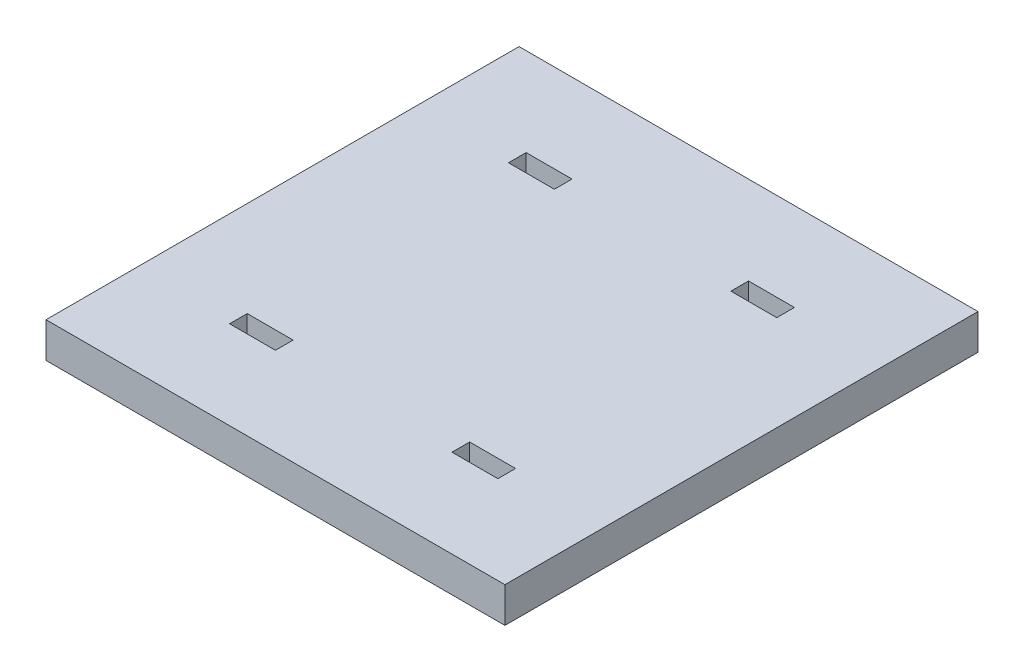
ISO-10303-21;
HEADER;
FILE_DESCRIPTION(('STEP AP214'),'2;1');
FILE_NAME('part.step','',(''),(''),'','','');
FILE_SCHEMA(('AUTOMOTIVE_DESIGN { 1 0 10303 214 1 1 1 1 }'));
ENDSEC;
DATA;
#1=APPLICATION_CONTEXT('core data for automotive mechanical design processes');
#2=APPLICATION_PROTOCOL_DEFINITION('international standard','automotive_design',2000,#1);
#3=PRODUCT_CONTEXT('',#1,'mechanical');
#4=PRODUCT('Part','Part','',(#3));
#5=PRODUCT_RELATED_PRODUCT_CATEGORY('part','',(#4));
#6=PRODUCT_DEFINITION_FORMATION('','',#4);
#7=PRODUCT_DEFINITION_CONTEXT('part definition',#1,'design');
#8=PRODUCT_DEFINITION('design','',#6,#7);
#9=PRODUCT_DEFINITION_SHAPE('','',#8);
#10=(LENGTH_UNIT() NAMED_UNIT(*) SI_UNIT(.MILLI.,.METRE.));
#11=(NAMED_UNIT(*) PLANE_ANGLE_UNIT() SI_UNIT($,.RADIAN.));
#12=(NAMED_UNIT(*) SI_UNIT($,.STERADIAN.) SOLID_ANGLE_UNIT());
#13=UNCERTAINTY_MEASURE_WITH_UNIT(LENGTH_MEASURE(1.E-05),#10,'distance_accuracy_value','');
#14=(GEOMETRIC_REPRESENTATION_CONTEXT(3) GLOBAL_UNCERTAINTY_ASSIGNED_CONTEXT((#13)) GLOBAL_UNIT_ASSIGNED_CONTEXT((#10,
#11,#12)) REPRESENTATION_CONTEXT('',''));
#15=CARTESIAN_POINT('',(0.,0.,0.));
#16=DIRECTION('',(0.,0.,1.));
#17=DIRECTION('',(1.,0.,0.));
#18=AXIS2_PLACEMENT_3D('',#15,#16,#17);
#19=CARTESIAN_POINT('',(0.,10.,0.));
#20=DIRECTION('',(0.,-1.,0.));
#21=DIRECTION('',(0.,0.,-1.));
#22=AXIS2_PLACEMENT_3D('',#19,#20,#21);
#23=PLANE('',#22);
#24=DIRECTION('',(1.,0.,0.));
#25=VECTOR('',#24,1.);
#26=CARTESIAN_POINT('',(103.,10.,-25.));
#27=LINE('',#26,#25);
#28=CARTESIAN_POINT('',(90.,10.,-25.));
#29=VERTEX_POINT('',#28);
#30=CARTESIAN_POINT('',(103.,10.,-25.));
#31=VERTEX_POINT('',#30);
#32=EDGE_CURVE('E209',#29,#31,#27,.T.);
#33=ORIENTED_EDGE('',*,*,#32,.F.);
#34=DIRECTION('',(0.,0.,1.));
#35=VECTOR('',#34,1.);
#36=CARTESIAN_POINT('',(90.,10.,-25.));
#37=LINE('',#36,#35);
#38=CARTESIAN_POINT('',(90.,10.,-30.));
#39=VERTEX_POINT('',#38);
#40=EDGE_CURVE('E217',#39,#29,#37,.T.);
#41=ORIENTED_EDGE('',*,*,#40,.F.);
#42=DIRECTION('',(-1.,0.,0.));
#43=VECTOR('',#42,1.);
#44=CARTESIAN_POINT('',(103.,10.,-30.));
#45=LINE('',#44,#43);
#46=CARTESIAN_POINT('',(103.,10.,-30.));
#47=VERTEX_POINT('',#46);
#48=EDGE_CURVE('E214',#47,#39,#45,.T.);
#49=ORIENTED_EDGE('',*,*,#48,.F.);
#50=DIRECTION('',(0.,0.,-1.));
#51=VECTOR('',#50,1.);
#52=CARTESIAN_POINT('',(103.,10.,-25.));
#53=LINE('',#52,#51);
#54=EDGE_CURVE('E211',#31,#47,#53,.T.);
#55=ORIENTED_EDGE('',*,*,#54,.F.);
#56=EDGE_LOOP('',(#33,#41,#49,#55));
#57=FACE_BOUND('',#56,.T.);
#58=DIRECTION('',(0.,0.,1.));
#59=VECTOR('',#58,1.);
#60=CARTESIAN_POINT('',(27.,10.,-109.));
#61=LINE('',#60,#59);
#62=CARTESIAN_POINT('',(27.,10.,-109.));
#63=VERTEX_POINT('',#62);
#64=CARTESIAN_POINT('',(27.,10.,-104.));
#65=VERTEX_POINT('',#64);
#66=EDGE_CURVE('E271',#63,#65,#61,.T.);
#67=ORIENTED_EDGE('',*,*,#66,.F.);
#68=DIRECTION('',(-1.,0.,0.));
#69=VECTOR('',#68,1.);
#70=CARTESIAN_POINT('',(27.,10.,-109.));
#71=LINE('',#70,#69);
#72=CARTESIAN_POINT('',(40.,10.,-109.));
#73=VERTEX_POINT('',#72);
#74=EDGE_CURVE('E279',#73,#63,#71,.T.);
#75=ORIENTED_EDGE('',*,*,#74,.F.);
#76=DIRECTION('',(0.,0.,-1.));
#77=VECTOR('',#76,1.);
#78=CARTESIAN_POINT('',(40.,10.,-109.));
#79=LINE('',#78,#77);
#80=CARTESIAN_POINT('',(40.,10.,-104.));
#81=VERTEX_POINT('',#80);
#82=EDGE_CURVE('E276',#81,#73,#79,.T.);
#83=ORIENTED_EDGE('',*,*,#82,.F.);
#84=DIRECTION('',(1.,0.,0.));
#85=VECTOR('',#84,1.);
#86=CARTESIAN_POINT('',(27.,10.,-104.));
#87=LINE('',#86,#85);
#88=EDGE_CURVE('E273',#65,#81,#87,.T.);
#89=ORIENTED_EDGE('',*,*,#88,.F.);
#90=EDGE_LOOP('',(#67,#75,#83,#89));
#91=FACE_BOUND('',#90,.T.);
#92=DIRECTION('',(0.,0.,1.));
#93=VECTOR('',#92,1.);
#94=CARTESIAN_POINT('',(0.,10.,0.));
#95=LINE('',#94,#93);
#96=CARTESIAN_POINT('',(0.,10.,-134.));
#97=VERTEX_POINT('',#96);
#98=CARTESIAN_POINT('',(0.,10.,0.));
#99=VERTEX_POINT('',#98);
#100=EDGE_CURVE('E302',#97,#99,#95,.T.);
#101=ORIENTED_EDGE('',*,*,#100,.T.);
#102=DIRECTION('',(1.,0.,0.));
#103=VECTOR('',#102,1.);
#104=CARTESIAN_POINT('',(0.,10.,0.));
#105=LINE('',#104,#103);
#106=CARTESIAN_POINT('',(130.,10.,0.));
#107=VERTEX_POINT('',#106);
#108=EDGE_CURVE('E305',#99,#107,#105,.T.);
#109=ORIENTED_EDGE('',*,*,#108,.T.);
#110=DIRECTION('',(0.,0.,-1.));
#111=VECTOR('',#110,1.);
#112=CARTESIAN_POINT('',(130.,10.,0.));
#113=LINE('',#112,#111);
#114=CARTESIAN_POINT('',(130.,10.,-134.));
#115=VERTEX_POINT('',#114);
#116=EDGE_CURVE('E308',#107,#115,#113,.T.);
#117=ORIENTED_EDGE('',*,*,#116,.T.);
#118=DIRECTION('',(-1.,0.,0.));
#119=VECTOR('',#118,1.);
#120=CARTESIAN_POINT('',(0.,10.,-134.));
#121=LINE('',#120,#119);
#122=EDGE_CURVE('E310',#115,#97,#121,.T.);
#123=ORIENTED_EDGE('',*,*,#122,.T.);
#124=EDGE_LOOP('',(#101,#109,#117,#123));
#125=FACE_BOUND('',#124,.T.);
#126=DIRECTION('',(0.,0.,1.));
#127=VECTOR('',#126,1.);
#128=CARTESIAN_POINT('',(27.,10.,-25.));
#129=LINE('',#128,#127);
#130=CARTESIAN_POINT('',(27.,10.,-30.));
#131=VERTEX_POINT('',#130);
#132=CARTESIAN_POINT('',(27.,10.,-25.));
#133=VERTEX_POINT('',#132);
#134=EDGE_CURVE('E240',#131,#133,#129,.T.);
#135=ORIENTED_EDGE('',*,*,#134,.F.);
#136=DIRECTION('',(-1.,0.,0.));
#137=VECTOR('',#136,1.);
#138=CARTESIAN_POINT('',(27.,10.,-30.));
#139=LINE('',#138,#137);
#140=CARTESIAN_POINT('',(40.,10.,-30.));
#141=VERTEX_POINT('',#140);
#142=EDGE_CURVE('E248',#141,#131,#139,.T.);
#143=ORIENTED_EDGE('',*,*,#142,.F.);
#144=DIRECTION('',(0.,0.,-1.));
#145=VECTOR('',#144,1.);
#146=CARTESIAN_POINT('',(40.,10.,-25.));
#147=LINE('',#146,#145);
#148=CARTESIAN_POINT('',(40.,10.,-25.));
#149=VERTEX_POINT('',#148);
#150=EDGE_CURVE('E245',#149,#141,#147,.T.);
#151=ORIENTED_EDGE('',*,*,#150,.F.);
#152=DIRECTION('',(1.,0.,0.));
#153=VECTOR('',#152,1.);
#154=CARTESIAN_POINT('',(27.,10.,-25.));
#155=LINE('',#154,#153);
#156=EDGE_CURVE('E242',#133,#149,#155,.T.);
#157=ORIENTED_EDGE('',*,*,#156,.F.);
#158=EDGE_LOOP('',(#135,#143,#151,#157));
#159=FACE_BOUND('',#158,.T.);
#160=DIRECTION('',(0.,0.,-1.));
#161=VECTOR('',#160,1.);
#162=CARTESIAN_POINT('',(103.,10.,-109.));
#163=LINE('',#162,#161);
#164=CARTESIAN_POINT('',(103.,10.,-104.));
#165=VERTEX_POINT('',#164);
#166=CARTESIAN_POINT('',(103.,10.,-109.));
#167=VERTEX_POINT('',#166);
#168=EDGE_CURVE('E173',#165,#167,#163,.T.);
#169=ORIENTED_EDGE('',*,*,#168,.F.);
#170=DIRECTION('',(1.,0.,0.));
#171=VECTOR('',#170,1.);
#172=CARTESIAN_POINT('',(103.,10.,-104.));
#173=LINE('',#172,#171);
#174=CARTESIAN_POINT('',(90.,10.,-104.));
#175=VERTEX_POINT('',#174);
#176=EDGE_CURVE('E195',#175,#165,#173,.T.);
#177=ORIENTED_EDGE('',*,*,#176,.F.);
#178=DIRECTION('',(0.,0.,1.));
#179=VECTOR('',#178,1.);
#180=CARTESIAN_POINT('',(90.,10.,-109.));
#181=LINE('',#180,#179);
#182=CARTESIAN_POINT('',(90.,10.,-109.));
#183=VERTEX_POINT('',#182);
#184=EDGE_CURVE('E193',#183,#175,#181,.T.);
#185=ORIENTED_EDGE('',*,*,#184,.F.);
#186=DIRECTION('',(-1.,0.,0.));
#187=VECTOR('',#186,1.);
#188=CARTESIAN_POINT('',(103.,10.,-109.));
#189=LINE('',#188,#187);
#190=EDGE_CURVE('E181',#167,#183,#189,.T.);
#191=ORIENTED_EDGE('',*,*,#190,.F.);
#192=EDGE_LOOP('',(#169,#177,#185,#191));
#193=FACE_BOUND('',#192,.T.);
#194=ADVANCED_FACE('F36',(#57,#91,#125,#159,#193),#23,.F.);
#195=CARTESIAN_POINT('',(0.,0.,0.));
#196=DIRECTION('',(0.,-1.,0.));
#197=DIRECTION('',(0.,0.,-1.));
#198=AXIS2_PLACEMENT_3D('',#195,#196,#197);
#199=PLANE('',#198);
#200=DIRECTION('',(0.,0.,1.));
#201=VECTOR('',#200,1.);
#202=CARTESIAN_POINT('',(0.,0.,0.));
#203=LINE('',#202,#201);
#204=CARTESIAN_POINT('',(0.,0.,-134.));
#205=VERTEX_POINT('',#204);
#206=CARTESIAN_POINT('',(0.,0.,0.));
#207=VERTEX_POINT('',#206);
#208=EDGE_CURVE('E301',#205,#207,#203,.T.);
#209=ORIENTED_EDGE('',*,*,#208,.F.);
#210=DIRECTION('',(-1.,0.,0.));
#211=VECTOR('',#210,1.);
#212=CARTESIAN_POINT('',(0.,0.,-134.));
#213=LINE('',#212,#211);
#214=CARTESIAN_POINT('',(130.,0.,-134.));
#215=VERTEX_POINT('',#214);
#216=EDGE_CURVE('E306',#215,#205,#213,.T.);
#217=ORIENTED_EDGE('',*,*,#216,.F.);
#218=DIRECTION('',(0.,0.,-1.));
#219=VECTOR('',#218,1.);
#220=CARTESIAN_POINT('',(130.,0.,0.));
#221=LINE('',#220,#219);
#222=CARTESIAN_POINT('',(130.,0.,0.));
#223=VERTEX_POINT('',#222);
#224=EDGE_CURVE('E317',#223,#215,#221,.T.);
#225=ORIENTED_EDGE('',*,*,#224,.F.);
#226=DIRECTION('',(1.,0.,0.));
#227=VECTOR('',#226,1.);
#228=CARTESIAN_POINT('',(0.,0.,0.));
#229=LINE('',#228,#227);
#230=EDGE_CURVE('E315',#207,#223,#229,.T.);
#231=ORIENTED_EDGE('',*,*,#230,.F.);
#232=EDGE_LOOP('',(#209,#217,#225,#231));
#233=FACE_BOUND('',#232,.T.);
#234=DIRECTION('',(-1.,0.,0.));
#235=VECTOR('',#234,1.);
#236=CARTESIAN_POINT('',(27.,0.,-109.));
#237=LINE('',#236,#235);
#238=CARTESIAN_POINT('',(40.,0.,-109.));
#239=VERTEX_POINT('',#238);
#240=CARTESIAN_POINT('',(27.,0.,-109.));
#241=VERTEX_POINT('',#240);
#242=EDGE_CURVE('E274',#239,#241,#237,.T.);
#243=ORIENTED_EDGE('',*,*,#242,.T.);
#244=DIRECTION('',(0.,0.,1.));
#245=VECTOR('',#244,1.);
#246=CARTESIAN_POINT('',(27.,0.,-109.));
#247=LINE('',#246,#245);
#248=CARTESIAN_POINT('',(27.,0.,-104.));
#249=VERTEX_POINT('',#248);
#250=EDGE_CURVE('E270',#241,#249,#247,.T.);
#251=ORIENTED_EDGE('',*,*,#250,.T.);
#252=DIRECTION('',(1.,0.,0.));
#253=VECTOR('',#252,1.);
#254=CARTESIAN_POINT('',(27.,0.,-104.));
#255=LINE('',#254,#253);
#256=CARTESIAN_POINT('',(40.,0.,-104.));
#257=VERTEX_POINT('',#256);
#258=EDGE_CURVE('E284',#249,#257,#255,.T.);
#259=ORIENTED_EDGE('',*,*,#258,.T.);
#260=DIRECTION('',(0.,0.,-1.));
#261=VECTOR('',#260,1.);
#262=CARTESIAN_POINT('',(40.,0.,-109.));
#263=LINE('',#262,#261);
#264=EDGE_CURVE('E287',#257,#239,#263,.T.);
#265=ORIENTED_EDGE('',*,*,#264,.T.);
#266=EDGE_LOOP('',(#243,#251,#259,#265));
#267=FACE_BOUND('',#266,.T.);
#268=DIRECTION('',(-1.,0.,0.));
#269=VECTOR('',#268,1.);
#270=CARTESIAN_POINT('',(27.,0.,-30.));
#271=LINE('',#270,#269);
#272=CARTESIAN_POINT('',(40.,0.,-30.));
#273=VERTEX_POINT('',#272);
#274=CARTESIAN_POINT('',(27.,0.,-30.));
#275=VERTEX_POINT('',#274);
#276=EDGE_CURVE('E243',#273,#275,#271,.T.);
#277=ORIENTED_EDGE('',*,*,#276,.T.);
#278=DIRECTION('',(0.,0.,1.));
#279=VECTOR('',#278,1.);
#280=CARTESIAN_POINT('',(27.,0.,-25.));
#281=LINE('',#280,#279);
#282=CARTESIAN_POINT('',(27.,0.,-25.));
#283=VERTEX_POINT('',#282);
#284=EDGE_CURVE('E239',#275,#283,#281,.T.);
#285=ORIENTED_EDGE('',*,*,#284,.T.);
#286=DIRECTION('',(1.,0.,0.));
#287=VECTOR('',#286,1.);
#288=CARTESIAN_POINT('',(27.,0.,-25.));
#289=LINE('',#288,#287);
#290=CARTESIAN_POINT('',(40.,0.,-25.));
#291=VERTEX_POINT('',#290);
#292=EDGE_CURVE('E253',#283,#291,#289,.T.);
#293=ORIENTED_EDGE('',*,*,#292,.T.);
#294=DIRECTION('',(0.,0.,-1.));
#295=VECTOR('',#294,1.);
#296=CARTESIAN_POINT('',(40.,0.,-25.));
#297=LINE('',#296,#295);
#298=EDGE_CURVE('E256',#291,#273,#297,.T.);
#299=ORIENTED_EDGE('',*,*,#298,.T.);
#300=EDGE_LOOP('',(#277,#285,#293,#299));
#301=FACE_BOUND('',#300,.T.);
#302=DIRECTION('',(0.,0.,1.));
#303=VECTOR('',#302,1.);
#304=CARTESIAN_POINT('',(90.,0.,-25.));
#305=LINE('',#304,#303);
#306=CARTESIAN_POINT('',(90.,0.,-30.));
#307=VERTEX_POINT('',#306);
#308=CARTESIAN_POINT('',(90.,0.,-25.));
#309=VERTEX_POINT('',#308);
#310=EDGE_CURVE('E212',#307,#309,#305,.T.);
#311=ORIENTED_EDGE('',*,*,#310,.T.);
#312=DIRECTION('',(1.,0.,0.));
#313=VECTOR('',#312,1.);
#314=CARTESIAN_POINT('',(103.,0.,-25.));
#315=LINE('',#314,#313);
#316=CARTESIAN_POINT('',(103.,0.,-25.));
#317=VERTEX_POINT('',#316);
#318=EDGE_CURVE('E189',#309,#317,#315,.T.);
#319=ORIENTED_EDGE('',*,*,#318,.T.);
#320=DIRECTION('',(0.,0.,-1.));
#321=VECTOR('',#320,1.);
#322=CARTESIAN_POINT('',(103.,0.,-25.));
#323=LINE('',#322,#321);
#324=CARTESIAN_POINT('',(103.,0.,-30.));
#325=VERTEX_POINT('',#324);
#326=EDGE_CURVE('E222',#317,#325,#323,.T.);
#327=ORIENTED_EDGE('',*,*,#326,.T.);
#328=DIRECTION('',(-1.,0.,0.));
#329=VECTOR('',#328,1.);
#330=CARTESIAN_POINT('',(103.,0.,-30.));
#331=LINE('',#330,#329);
#332=EDGE_CURVE('E225',#325,#307,#331,.T.);
#333=ORIENTED_EDGE('',*,*,#332,.T.);
#334=EDGE_LOOP('',(#311,#319,#327,#333));
#335=FACE_BOUND('',#334,.T.);
#336=DIRECTION('',(1.,0.,0.));
#337=VECTOR('',#336,1.);
#338=CARTESIAN_POINT('',(103.,0.,-104.));
#339=LINE('',#338,#337);
#340=CARTESIAN_POINT('',(90.,0.,-104.));
#341=VERTEX_POINT('',#340);
#342=CARTESIAN_POINT('',(103.,0.,-104.));
#343=VERTEX_POINT('',#342);
#344=EDGE_CURVE('E182',#341,#343,#339,.T.);
#345=ORIENTED_EDGE('',*,*,#344,.T.);
#346=DIRECTION('',(0.,0.,-1.));
#347=VECTOR('',#346,1.);
#348=CARTESIAN_POINT('',(103.,0.,-109.));
#349=LINE('',#348,#347);
#350=CARTESIAN_POINT('',(103.,0.,-109.));
#351=VERTEX_POINT('',#350);
#352=EDGE_CURVE('E59',#343,#351,#349,.T.);
#353=ORIENTED_EDGE('',*,*,#352,.T.);
#354=DIRECTION('',(-1.,0.,0.));
#355=VECTOR('',#354,1.);
#356=CARTESIAN_POINT('',(103.,0.,-109.));
#357=LINE('',#356,#355);
#358=CARTESIAN_POINT('',(90.,0.,-109.));
#359=VERTEX_POINT('',#358);
#360=EDGE_CURVE('E188',#351,#359,#357,.T.);
#361=ORIENTED_EDGE('',*,*,#360,.T.);
#362=DIRECTION('',(0.,0.,1.));
#363=VECTOR('',#362,1.);
#364=CARTESIAN_POINT('',(90.,0.,-109.));
#365=LINE('',#364,#363);
#366=EDGE_CURVE('E201',#359,#341,#365,.T.);
#367=ORIENTED_EDGE('',*,*,#366,.T.);
#368=EDGE_LOOP('',(#345,#353,#361,#367));
#369=FACE_BOUND('',#368,.T.);
#370=ADVANCED_FACE('F335',(#233,#267,#301,#335,#369),#199,.T.);
#371=CARTESIAN_POINT('',(0.,10.,0.));
#372=DIRECTION('',(1.,0.,0.));
#373=DIRECTION('',(0.,0.,-1.));
#374=AXIS2_PLACEMENT_3D('',#371,#372,#373);
#375=PLANE('',#374);
#376=ORIENTED_EDGE('',*,*,#208,.T.);
#377=DIRECTION('',(0.,-1.,0.));
#378=VECTOR('',#377,1.);
#379=CARTESIAN_POINT('',(0.,10.,0.));
#380=LINE('',#379,#378);
#381=EDGE_CURVE('E11',#99,#207,#380,.T.);
#382=ORIENTED_EDGE('',*,*,#381,.F.);
#383=ORIENTED_EDGE('',*,*,#100,.F.);
#384=DIRECTION('',(0.,-1.,0.));
#385=VECTOR('',#384,1.);
#386=CARTESIAN_POINT('',(0.,10.,-134.));
#387=LINE('',#386,#385);
#388=EDGE_CURVE('E312',#97,#205,#387,.T.);
#389=ORIENTED_EDGE('',*,*,#388,.T.);
#390=EDGE_LOOP('',(#376,#382,#383,#389));
#391=FACE_BOUND('',#390,.T.);
#392=ADVANCED_FACE('F38',(#391),#375,.F.);
#393=CARTESIAN_POINT('',(0.,10.,0.));
#394=DIRECTION('',(0.,0.,-1.));
#395=DIRECTION('',(-1.,0.,0.));
#396=AXIS2_PLACEMENT_3D('',#393,#394,#395);
#397=PLANE('',#396);
#398=ORIENTED_EDGE('',*,*,#230,.T.);
#399=DIRECTION('',(0.,-1.,0.));
#400=VECTOR('',#399,1.);
#401=CARTESIAN_POINT('',(130.,10.,0.));
#402=LINE('',#401,#400);
#403=EDGE_CURVE('E44',#107,#223,#402,.T.);
#404=ORIENTED_EDGE('',*,*,#403,.F.);
#405=ORIENTED_EDGE('',*,*,#108,.F.);
#406=ORIENTED_EDGE('',*,*,#381,.T.);
#407=EDGE_LOOP('',(#398,#404,#405,#406));
#408=FACE_BOUND('',#407,.T.);
#409=ADVANCED_FACE('F346',(#408),#397,.F.);
#410=CARTESIAN_POINT('',(130.,10.,0.));
#411=DIRECTION('',(-1.,0.,0.));
#412=DIRECTION('',(0.,0.,1.));
#413=AXIS2_PLACEMENT_3D('',#410,#411,#412);
#414=PLANE('',#413);
#415=ORIENTED_EDGE('',*,*,#224,.T.);
#416=DIRECTION('',(0.,-1.,0.));
#417=VECTOR('',#416,1.);
#418=CARTESIAN_POINT('',(130.,10.,-134.));
#419=LINE('',#418,#417);
#420=EDGE_CURVE('E322',#115,#215,#419,.T.);
#421=ORIENTED_EDGE('',*,*,#420,.F.);
#422=ORIENTED_EDGE('',*,*,#116,.F.);
#423=ORIENTED_EDGE('',*,*,#403,.T.);
#424=EDGE_LOOP('',(#415,#421,#422,#423));
#425=FACE_BOUND('',#424,.T.);
#426=ADVANCED_FACE('F329',(#425),#414,.F.);
#427=CARTESIAN_POINT('',(0.,10.,-134.));
#428=DIRECTION('',(0.,0.,1.));
#429=DIRECTION('',(1.,0.,0.));
#430=AXIS2_PLACEMENT_3D('',#427,#428,#429);
#431=PLANE('',#430);
#432=ORIENTED_EDGE('',*,*,#216,.T.);
#433=ORIENTED_EDGE('',*,*,#388,.F.);
#434=ORIENTED_EDGE('',*,*,#122,.F.);
#435=ORIENTED_EDGE('',*,*,#420,.T.);
#436=EDGE_LOOP('',(#432,#433,#434,#435));
#437=FACE_BOUND('',#436,.T.);
#438=ADVANCED_FACE('F339',(#437),#431,.F.);
#439=CARTESIAN_POINT('',(27.,10.,-109.));
#440=DIRECTION('',(1.,0.,0.));
#441=DIRECTION('',(0.,0.,-1.));
#442=AXIS2_PLACEMENT_3D('',#439,#440,#441);
#443=PLANE('',#442);
#444=ORIENTED_EDGE('',*,*,#250,.F.);
#445=DIRECTION('',(0.,-1.,0.));
#446=VECTOR('',#445,1.);
#447=CARTESIAN_POINT('',(27.,10.,-109.));
#448=LINE('',#447,#446);
#449=EDGE_CURVE('E281',#63,#241,#448,.T.);
#450=ORIENTED_EDGE('',*,*,#449,.F.);
#451=ORIENTED_EDGE('',*,*,#66,.T.);
#452=DIRECTION('',(0.,-1.,0.));
#453=VECTOR('',#452,1.);
#454=CARTESIAN_POINT('',(27.,10.,-104.));
#455=LINE('',#454,#453);
#456=EDGE_CURVE('E298',#65,#249,#455,.T.);
#457=ORIENTED_EDGE('',*,*,#456,.T.);
#458=EDGE_LOOP('',(#444,#450,#451,#457));
#459=FACE_BOUND('',#458,.T.);
#460=ADVANCED_FACE('F363',(#459),#443,.T.);
#461=CARTESIAN_POINT('',(27.,10.,-104.));
#462=DIRECTION('',(0.,0.,-1.));
#463=DIRECTION('',(-1.,0.,0.));
#464=AXIS2_PLACEMENT_3D('',#461,#462,#463);
#465=PLANE('',#464);
#466=ORIENTED_EDGE('',*,*,#258,.F.);
#467=ORIENTED_EDGE('',*,*,#456,.F.);
#468=ORIENTED_EDGE('',*,*,#88,.T.);
#469=DIRECTION('',(0.,-1.,0.));
#470=VECTOR('',#469,1.);
#471=CARTESIAN_POINT('',(40.,10.,-104.));
#472=LINE('',#471,#470);
#473=EDGE_CURVE('E296',#81,#257,#472,.T.);
#474=ORIENTED_EDGE('',*,*,#473,.T.);
#475=EDGE_LOOP('',(#466,#467,#468,#474));
#476=FACE_BOUND('',#475,.T.);
#477=ADVANCED_FACE('F370',(#476),#465,.T.);
#478=CARTESIAN_POINT('',(40.,10.,-109.));
#479=DIRECTION('',(-1.,0.,0.));
#480=DIRECTION('',(0.,0.,1.));
#481=AXIS2_PLACEMENT_3D('',#478,#479,#480);
#482=PLANE('',#481);
#483=ORIENTED_EDGE('',*,*,#264,.F.);
#484=ORIENTED_EDGE('',*,*,#473,.F.);
#485=ORIENTED_EDGE('',*,*,#82,.T.);
#486=DIRECTION('',(0.,-1.,0.));
#487=VECTOR('',#486,1.);
#488=CARTESIAN_POINT('',(40.,10.,-109.));
#489=LINE('',#488,#487);
#490=EDGE_CURVE('E294',#73,#239,#489,.T.);
#491=ORIENTED_EDGE('',*,*,#490,.T.);
#492=EDGE_LOOP('',(#483,#484,#485,#491));
#493=FACE_BOUND('',#492,.T.);
#494=ADVANCED_FACE('F375',(#493),#482,.T.);
#495=CARTESIAN_POINT('',(27.,10.,-109.));
#496=DIRECTION('',(0.,0.,1.));
#497=DIRECTION('',(1.,0.,0.));
#498=AXIS2_PLACEMENT_3D('',#495,#496,#497);
#499=PLANE('',#498);
#500=ORIENTED_EDGE('',*,*,#242,.F.);
#501=ORIENTED_EDGE('',*,*,#490,.F.);
#502=ORIENTED_EDGE('',*,*,#74,.T.);
#503=ORIENTED_EDGE('',*,*,#449,.T.);
#504=EDGE_LOOP('',(#500,#501,#502,#503));
#505=FACE_BOUND('',#504,.T.);
#506=ADVANCED_FACE('F382',(#505),#499,.T.);
#507=CARTESIAN_POINT('',(27.,10.,-25.));
#508=DIRECTION('',(1.,0.,0.));
#509=DIRECTION('',(0.,0.,-1.));
#510=AXIS2_PLACEMENT_3D('',#507,#508,#509);
#511=PLANE('',#510);
#512=ORIENTED_EDGE('',*,*,#284,.F.);
#513=DIRECTION('',(0.,-1.,0.));
#514=VECTOR('',#513,1.);
#515=CARTESIAN_POINT('',(27.,10.,-30.));
#516=LINE('',#515,#514);
#517=EDGE_CURVE('E250',#131,#275,#516,.T.);
#518=ORIENTED_EDGE('',*,*,#517,.F.);
#519=ORIENTED_EDGE('',*,*,#134,.T.);
#520=DIRECTION('',(0.,-1.,0.));
#521=VECTOR('',#520,1.);
#522=CARTESIAN_POINT('',(27.,10.,-25.));
#523=LINE('',#522,#521);
#524=EDGE_CURVE('E267',#133,#283,#523,.T.);
#525=ORIENTED_EDGE('',*,*,#524,.T.);
#526=EDGE_LOOP('',(#512,#518,#519,#525));
#527=FACE_BOUND('',#526,.T.);
#528=ADVANCED_FACE('F395',(#527),#511,.T.);
#529=CARTESIAN_POINT('',(27.,10.,-25.));
#530=DIRECTION('',(0.,0.,-1.));
#531=DIRECTION('',(-1.,0.,0.));
#532=AXIS2_PLACEMENT_3D('',#529,#530,#531);
#533=PLANE('',#532);
#534=ORIENTED_EDGE('',*,*,#292,.F.);
#535=ORIENTED_EDGE('',*,*,#524,.F.);
#536=ORIENTED_EDGE('',*,*,#156,.T.);
#537=DIRECTION('',(0.,-1.,0.));
#538=VECTOR('',#537,1.);
#539=CARTESIAN_POINT('',(40.,10.,-25.));
#540=LINE('',#539,#538);
#541=EDGE_CURVE('E265',#149,#291,#540,.T.);
#542=ORIENTED_EDGE('',*,*,#541,.T.);
#543=EDGE_LOOP('',(#534,#535,#536,#542));
#544=FACE_BOUND('',#543,.T.);
#545=ADVANCED_FACE('F400',(#544),#533,.T.);
#546=CARTESIAN_POINT('',(40.,10.,-25.));
#547=DIRECTION('',(-1.,0.,0.));
#548=DIRECTION('',(0.,0.,1.));
#549=AXIS2_PLACEMENT_3D('',#546,#547,#548);
#550=PLANE('',#549);
#551=ORIENTED_EDGE('',*,*,#298,.F.);
#552=ORIENTED_EDGE('',*,*,#541,.F.);
#553=ORIENTED_EDGE('',*,*,#150,.T.);
#554=DIRECTION('',(0.,-1.,0.));
#555=VECTOR('',#554,1.);
#556=CARTESIAN_POINT('',(40.,10.,-30.));
#557=LINE('',#556,#555);
#558=EDGE_CURVE('E263',#141,#273,#557,.T.);
#559=ORIENTED_EDGE('',*,*,#558,.T.);
#560=EDGE_LOOP('',(#551,#552,#553,#559));
#561=FACE_BOUND('',#560,.T.);
#562=ADVANCED_FACE('F404',(#561),#550,.T.);
#563=CARTESIAN_POINT('',(27.,10.,-30.));
#564=DIRECTION('',(0.,0.,1.));
#565=DIRECTION('',(1.,0.,0.));
#566=AXIS2_PLACEMENT_3D('',#563,#564,#565);
#567=PLANE('',#566);
#568=ORIENTED_EDGE('',*,*,#276,.F.);
#569=ORIENTED_EDGE('',*,*,#558,.F.);
#570=ORIENTED_EDGE('',*,*,#142,.T.);
#571=ORIENTED_EDGE('',*,*,#517,.T.);
#572=EDGE_LOOP('',(#568,#569,#570,#571));
#573=FACE_BOUND('',#572,.T.);
#574=ADVANCED_FACE('F408',(#573),#567,.T.);
#575=CARTESIAN_POINT('',(103.,10.,-25.));
#576=DIRECTION('',(0.,0.,-1.));
#577=DIRECTION('',(-1.,0.,0.));
#578=AXIS2_PLACEMENT_3D('',#575,#576,#577);
#579=PLANE('',#578);
#580=ORIENTED_EDGE('',*,*,#318,.F.);
#581=DIRECTION('',(0.,-1.,0.));
#582=VECTOR('',#581,1.);
#583=CARTESIAN_POINT('',(90.,10.,-25.));
#584=LINE('',#583,#582);
#585=EDGE_CURVE('E219',#29,#309,#584,.T.);
#586=ORIENTED_EDGE('',*,*,#585,.F.);
#587=ORIENTED_EDGE('',*,*,#32,.T.);
#588=DIRECTION('',(0.,-1.,0.));
#589=VECTOR('',#588,1.);
#590=CARTESIAN_POINT('',(103.,10.,-25.));
#591=LINE('',#590,#589);
#592=EDGE_CURVE('E236',#31,#317,#591,.T.);
#593=ORIENTED_EDGE('',*,*,#592,.T.);
#594=EDGE_LOOP('',(#580,#586,#587,#593));
#595=FACE_BOUND('',#594,.T.);
#596=ADVANCED_FACE('F412',(#595),#579,.T.);
#597=CARTESIAN_POINT('',(103.,10.,-25.));
#598=DIRECTION('',(-1.,0.,0.));
#599=DIRECTION('',(0.,0.,1.));
#600=AXIS2_PLACEMENT_3D('',#597,#598,#599);
#601=PLANE('',#600);
#602=ORIENTED_EDGE('',*,*,#326,.F.);
#603=ORIENTED_EDGE('',*,*,#592,.F.);
#604=ORIENTED_EDGE('',*,*,#54,.T.);
#605=DIRECTION('',(0.,-1.,0.));
#606=VECTOR('',#605,1.);
#607=CARTESIAN_POINT('',(103.,10.,-30.));
#608=LINE('',#607,#606);
#609=EDGE_CURVE('E234',#47,#325,#608,.T.);
#610=ORIENTED_EDGE('',*,*,#609,.T.);
#611=EDGE_LOOP('',(#602,#603,#604,#610));
#612=FACE_BOUND('',#611,.T.);
#613=ADVANCED_FACE('F416',(#612),#601,.T.);
#614=CARTESIAN_POINT('',(103.,10.,-30.));
#615=DIRECTION('',(0.,0.,1.));
#616=DIRECTION('',(1.,0.,0.));
#617=AXIS2_PLACEMENT_3D('',#614,#615,#616);
#618=PLANE('',#617);
#619=ORIENTED_EDGE('',*,*,#332,.F.);
#620=ORIENTED_EDGE('',*,*,#609,.F.);
#621=ORIENTED_EDGE('',*,*,#48,.T.);
#622=DIRECTION('',(0.,-1.,0.));
#623=VECTOR('',#622,1.);
#624=CARTESIAN_POINT('',(90.,10.,-30.));
#625=LINE('',#624,#623);
#626=EDGE_CURVE('E232',#39,#307,#625,.T.);
#627=ORIENTED_EDGE('',*,*,#626,.T.);
#628=EDGE_LOOP('',(#619,#620,#621,#627));
#629=FACE_BOUND('',#628,.T.);
#630=ADVANCED_FACE('F420',(#629),#618,.T.);
#631=CARTESIAN_POINT('',(90.,10.,-25.));
#632=DIRECTION('',(1.,0.,0.));
#633=DIRECTION('',(0.,0.,-1.));
#634=AXIS2_PLACEMENT_3D('',#631,#632,#633);
#635=PLANE('',#634);
#636=ORIENTED_EDGE('',*,*,#310,.F.);
#637=ORIENTED_EDGE('',*,*,#626,.F.);
#638=ORIENTED_EDGE('',*,*,#40,.T.);
#639=ORIENTED_EDGE('',*,*,#585,.T.);
#640=EDGE_LOOP('',(#636,#637,#638,#639));
#641=FACE_BOUND('',#640,.T.);
#642=ADVANCED_FACE('F424',(#641),#635,.T.);
#643=CARTESIAN_POINT('',(103.,10.,-109.));
#644=DIRECTION('',(-1.,0.,0.));
#645=DIRECTION('',(0.,0.,1.));
#646=AXIS2_PLACEMENT_3D('',#643,#644,#645);
#647=PLANE('',#646);
#648=ORIENTED_EDGE('',*,*,#352,.F.);
#649=DIRECTION('',(0.,-1.,0.));
#650=VECTOR('',#649,1.);
#651=CARTESIAN_POINT('',(103.,10.,-104.));
#652=LINE('',#651,#650);
#653=EDGE_CURVE('E177',#165,#343,#652,.T.);
#654=ORIENTED_EDGE('',*,*,#653,.F.);
#655=ORIENTED_EDGE('',*,*,#168,.T.);
#656=DIRECTION('',(0.,-1.,0.));
#657=VECTOR('',#656,1.);
#658=CARTESIAN_POINT('',(103.,10.,-109.));
#659=LINE('',#658,#657);
#660=EDGE_CURVE('E176',#167,#351,#659,.T.);
#661=ORIENTED_EDGE('',*,*,#660,.T.);
#662=EDGE_LOOP('',(#648,#654,#655,#661));
#663=FACE_BOUND('',#662,.T.);
#664=ADVANCED_FACE('F175',(#663),#647,.T.);
#665=CARTESIAN_POINT('',(103.,10.,-109.));
#666=DIRECTION('',(0.,0.,1.));
#667=DIRECTION('',(1.,0.,0.));
#668=AXIS2_PLACEMENT_3D('',#665,#666,#667);
#669=PLANE('',#668);
#670=ORIENTED_EDGE('',*,*,#360,.F.);
#671=ORIENTED_EDGE('',*,*,#660,.F.);
#672=ORIENTED_EDGE('',*,*,#190,.T.);
#673=DIRECTION('',(0.,-1.,0.));
#674=VECTOR('',#673,1.);
#675=CARTESIAN_POINT('',(90.,10.,-109.));
#676=LINE('',#675,#674);
#677=EDGE_CURVE('E190',#183,#359,#676,.T.);
#678=ORIENTED_EDGE('',*,*,#677,.T.);
#679=EDGE_LOOP('',(#670,#671,#672,#678));
#680=FACE_BOUND('',#679,.T.);
#681=ADVANCED_FACE('F185',(#680),#669,.T.);
#682=CARTESIAN_POINT('',(90.,10.,-109.));
#683=DIRECTION('',(1.,0.,0.));
#684=DIRECTION('',(0.,0.,-1.));
#685=AXIS2_PLACEMENT_3D('',#682,#683,#684);
#686=PLANE('',#685);
#687=ORIENTED_EDGE('',*,*,#366,.F.);
#688=ORIENTED_EDGE('',*,*,#677,.F.);
#689=ORIENTED_EDGE('',*,*,#184,.T.);
#690=DIRECTION('',(0.,-1.,0.));
#691=VECTOR('',#690,1.);
#692=CARTESIAN_POINT('',(90.,10.,-104.));
#693=LINE('',#692,#691);
#694=EDGE_CURVE('E51',#175,#341,#693,.T.);
#695=ORIENTED_EDGE('',*,*,#694,.T.);
#696=EDGE_LOOP('',(#687,#688,#689,#695));
#697=FACE_BOUND('',#696,.T.);
#698=ADVANCED_FACE('F433',(#697),#686,.T.);
#699=CARTESIAN_POINT('',(103.,10.,-104.));
#700=DIRECTION('',(0.,0.,-1.));
#701=DIRECTION('',(-1.,0.,0.));
#702=AXIS2_PLACEMENT_3D('',#699,#700,#701);
#703=PLANE('',#702);
#704=ORIENTED_EDGE('',*,*,#344,.F.);
#705=ORIENTED_EDGE('',*,*,#694,.F.);
#706=ORIENTED_EDGE('',*,*,#176,.T.);
#707=ORIENTED_EDGE('',*,*,#653,.T.);
#708=EDGE_LOOP('',(#704,#705,#706,#707));
#709=FACE_BOUND('',#708,.T.);
#710=ADVANCED_FACE('F436',(#709),#703,.T.);
#711=CLOSED_SHELL('',(#194,#370,#392,#409,#426,#438,#460,#477,#494,#506,#528,#545,#562,#574,
#596,#613,#630,#642,#664,#681,#698,#710));
#712=MANIFOLD_SOLID_BREP('B2',#711);
#713=ADVANCED_BREP_SHAPE_REPRESENTATION('',(#18,#712),#14);
#714=SHAPE_DEFINITION_REPRESENTATION(#9,#713);
ENDSEC;
END-ISO-10303-21;
